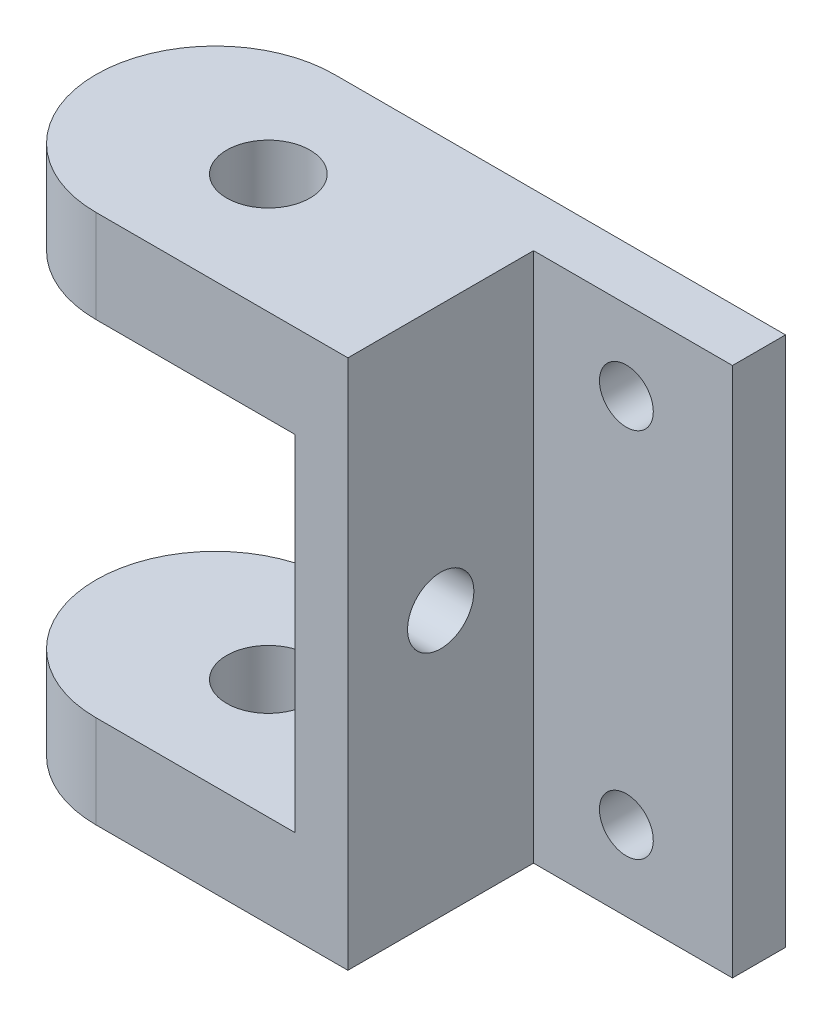
ISO-10303-21;
HEADER;
FILE_DESCRIPTION(('STEP AP214'),'2;1');
FILE_NAME('part.step','',(''),(''),'','','');
FILE_SCHEMA(('AUTOMOTIVE_DESIGN { 1 0 10303 214 1 1 1 1 }'));
ENDSEC;
DATA;
#1=APPLICATION_CONTEXT('core data for automotive mechanical design processes');
#2=APPLICATION_PROTOCOL_DEFINITION('international standard','automotive_design',2000,#1);
#3=PRODUCT_CONTEXT('',#1,'mechanical');
#4=PRODUCT('Part','Part','',(#3));
#5=PRODUCT_RELATED_PRODUCT_CATEGORY('part','',(#4));
#6=PRODUCT_DEFINITION_FORMATION('','',#4);
#7=PRODUCT_DEFINITION_CONTEXT('part definition',#1,'design');
#8=PRODUCT_DEFINITION('design','',#6,#7);
#9=PRODUCT_DEFINITION_SHAPE('','',#8);
#10=(LENGTH_UNIT() NAMED_UNIT(*) SI_UNIT(.MILLI.,.METRE.));
#11=(NAMED_UNIT(*) PLANE_ANGLE_UNIT() SI_UNIT($,.RADIAN.));
#12=(NAMED_UNIT(*) SI_UNIT($,.STERADIAN.) SOLID_ANGLE_UNIT());
#13=UNCERTAINTY_MEASURE_WITH_UNIT(LENGTH_MEASURE(1.E-05),#10,'distance_accuracy_value','');
#14=(GEOMETRIC_REPRESENTATION_CONTEXT(3) GLOBAL_UNCERTAINTY_ASSIGNED_CONTEXT((#13)) GLOBAL_UNIT_ASSIGNED_CONTEXT((#10,
#11,#12)) REPRESENTATION_CONTEXT('',''));
#15=CARTESIAN_POINT('',(0.,0.,0.));
#16=DIRECTION('',(0.,0.,1.));
#17=DIRECTION('',(1.,0.,0.));
#18=AXIS2_PLACEMENT_3D('',#15,#16,#17);
#19=CARTESIAN_POINT('',(0.,0.,0.));
#20=DIRECTION('',(1.,0.,0.));
#21=DIRECTION('',(0.,0.,-1.));
#22=AXIS2_PLACEMENT_3D('',#19,#20,#21);
#23=PLANE('',#22);
#24=CARTESIAN_POINT('',(0.,0.,0.200000000000002));
#25=DIRECTION('',(1.,0.,0.));
#26=DIRECTION('',(0.,0.,-1.));
#27=AXIS2_PLACEMENT_3D('',#24,#25,#26);
#28=CIRCLE('',#27,0.25);
#29=CARTESIAN_POINT('',(0.,0.,-0.0499999999999983));
#30=VERTEX_POINT('',#29);
#31=EDGE_CURVE('E277',#30,#30,#28,.T.);
#32=ORIENTED_EDGE('',*,*,#31,.T.);
#33=EDGE_LOOP('',(#32));
#34=FACE_BOUND('',#33,.T.);
#35=DIRECTION('',(0.,-1.,0.));
#36=VECTOR('',#35,1.);
#37=CARTESIAN_POINT('',(0.,0.,-0.899999999999998));
#38=LINE('',#37,#36);
#39=CARTESIAN_POINT('',(0.,1.3,-0.899999999999998));
#40=VERTEX_POINT('',#39);
#41=CARTESIAN_POINT('',(0.,-1.3,-0.899999999999999));
#42=VERTEX_POINT('',#41);
#43=EDGE_CURVE('E126',#40,#42,#38,.T.);
#44=ORIENTED_EDGE('',*,*,#43,.T.);
#45=DIRECTION('',(0.,0.,1.));
#46=VECTOR('',#45,1.);
#47=CARTESIAN_POINT('',(0.,-1.3,0.));
#48=LINE('',#47,#46);
#49=CARTESIAN_POINT('',(0.,-1.3,0.900000000000001));
#50=VERTEX_POINT('',#49);
#51=EDGE_CURVE('E130',#42,#50,#48,.T.);
#52=ORIENTED_EDGE('',*,*,#51,.T.);
#53=DIRECTION('',(0.,-1.,0.));
#54=VECTOR('',#53,1.);
#55=CARTESIAN_POINT('',(0.,0.,0.900000000000001));
#56=LINE('',#55,#54);
#57=CARTESIAN_POINT('',(0.,1.3,0.900000000000001));
#58=VERTEX_POINT('',#57);
#59=EDGE_CURVE('E153',#58,#50,#56,.T.);
#60=ORIENTED_EDGE('',*,*,#59,.F.);
#61=DIRECTION('',(0.,0.,1.));
#62=VECTOR('',#61,1.);
#63=CARTESIAN_POINT('',(0.,1.3,0.));
#64=LINE('',#63,#62);
#65=EDGE_CURVE('E142',#40,#58,#64,.T.);
#66=ORIENTED_EDGE('',*,*,#65,.F.);
#67=EDGE_LOOP('',(#44,#52,#60,#66));
#68=FACE_BOUND('',#67,.T.);
#69=ADVANCED_FACE('F34',(#34,#68),#23,.F.);
#70=CARTESIAN_POINT('',(0.4,0.,0.900000000000001));
#71=DIRECTION('',(0.,0.,-1.));
#72=DIRECTION('',(0.,1.,0.));
#73=AXIS2_PLACEMENT_3D('',#70,#71,#72);
#74=PLANE('',#73);
#75=DIRECTION('',(-1.,0.,0.));
#76=VECTOR('',#75,1.);
#77=CARTESIAN_POINT('',(0.4,2.,0.900000000000001));
#78=LINE('',#77,#76);
#79=CARTESIAN_POINT('',(0.4,2.,0.900000000000001));
#80=VERTEX_POINT('',#79);
#81=CARTESIAN_POINT('',(-1.5,2.,0.900000000000001));
#82=VERTEX_POINT('',#81);
#83=EDGE_CURVE('E207',#80,#82,#78,.T.);
#84=ORIENTED_EDGE('',*,*,#83,.T.);
#85=DIRECTION('',(0.,-1.,0.));
#86=VECTOR('',#85,1.);
#87=CARTESIAN_POINT('',(-1.5,0.,0.900000000000001));
#88=LINE('',#87,#86);
#89=CARTESIAN_POINT('',(-1.5,1.3,0.900000000000001));
#90=VERTEX_POINT('',#89);
#91=EDGE_CURVE('E225',#82,#90,#88,.T.);
#92=ORIENTED_EDGE('',*,*,#91,.T.);
#93=DIRECTION('',(1.,0.,0.));
#94=VECTOR('',#93,1.);
#95=CARTESIAN_POINT('',(-2.4,1.3,0.900000000000001));
#96=LINE('',#95,#94);
#97=EDGE_CURVE('E192',#90,#58,#96,.T.);
#98=ORIENTED_EDGE('',*,*,#97,.T.);
#99=ORIENTED_EDGE('',*,*,#59,.T.);
#100=DIRECTION('',(1.,0.,0.));
#101=VECTOR('',#100,1.);
#102=CARTESIAN_POINT('',(-2.4,-1.3,0.900000000000001));
#103=LINE('',#102,#101);
#104=CARTESIAN_POINT('',(-1.5,-1.3,0.900000000000001));
#105=VERTEX_POINT('',#104);
#106=EDGE_CURVE('E129',#105,#50,#103,.T.);
#107=ORIENTED_EDGE('',*,*,#106,.F.);
#108=DIRECTION('',(0.,-1.,0.));
#109=VECTOR('',#108,1.);
#110=CARTESIAN_POINT('',(-1.5,0.,0.900000000000001));
#111=LINE('',#110,#109);
#112=CARTESIAN_POINT('',(-1.5,-2.,0.900000000000001));
#113=VERTEX_POINT('',#112);
#114=EDGE_CURVE('E170',#105,#113,#111,.T.);
#115=ORIENTED_EDGE('',*,*,#114,.T.);
#116=DIRECTION('',(-1.,0.,0.));
#117=VECTOR('',#116,1.);
#118=CARTESIAN_POINT('',(0.4,-2.,0.900000000000001));
#119=LINE('',#118,#117);
#120=CARTESIAN_POINT('',(0.4,-2.,0.900000000000001));
#121=VERTEX_POINT('',#120);
#122=EDGE_CURVE('E201',#121,#113,#119,.T.);
#123=ORIENTED_EDGE('',*,*,#122,.F.);
#124=DIRECTION('',(0.,-1.,0.));
#125=VECTOR('',#124,1.);
#126=CARTESIAN_POINT('',(0.4,0.,0.900000000000001));
#127=LINE('',#126,#125);
#128=EDGE_CURVE('E163',#80,#121,#127,.T.);
#129=ORIENTED_EDGE('',*,*,#128,.F.);
#130=EDGE_LOOP('',(#84,#92,#98,#99,#107,#115,#123,#129));
#131=FACE_BOUND('',#130,.T.);
#132=ADVANCED_FACE('F221',(#131),#74,.F.);
#133=CARTESIAN_POINT('',(0.4,0.,0.));
#134=DIRECTION('',(1.,0.,0.));
#135=DIRECTION('',(0.,0.,-1.));
#136=AXIS2_PLACEMENT_3D('',#133,#134,#135);
#137=PLANE('',#136);
#138=CARTESIAN_POINT('',(0.4,0.,0.200000000000002));
#139=DIRECTION('',(1.,0.,0.));
#140=DIRECTION('',(0.,0.,-1.));
#141=AXIS2_PLACEMENT_3D('',#138,#139,#140);
#142=CIRCLE('',#141,0.25);
#143=CARTESIAN_POINT('',(0.4,0.,-0.0499999999999983));
#144=VERTEX_POINT('',#143);
#145=EDGE_CURVE('E274',#144,#144,#142,.T.);
#146=ORIENTED_EDGE('',*,*,#145,.F.);
#147=EDGE_LOOP('',(#146));
#148=FACE_BOUND('',#147,.T.);
#149=ORIENTED_EDGE('',*,*,#128,.T.);
#150=DIRECTION('',(0.,0.,-1.));
#151=VECTOR('',#150,1.);
#152=CARTESIAN_POINT('',(0.4,-2.,0.));
#153=LINE('',#152,#151);
#154=CARTESIAN_POINT('',(0.4,-2.,-0.499999999999998));
#155=VERTEX_POINT('',#154);
#156=EDGE_CURVE('E187',#121,#155,#153,.T.);
#157=ORIENTED_EDGE('',*,*,#156,.T.);
#158=DIRECTION('',(0.,-1.,0.));
#159=VECTOR('',#158,1.);
#160=CARTESIAN_POINT('',(0.4,0.,-0.499999999999998));
#161=LINE('',#160,#159);
#162=CARTESIAN_POINT('',(0.400000000000001,2.,-0.499999999999998));
#163=VERTEX_POINT('',#162);
#164=EDGE_CURVE('E164',#163,#155,#161,.T.);
#165=ORIENTED_EDGE('',*,*,#164,.F.);
#166=DIRECTION('',(0.,0.,-1.));
#167=VECTOR('',#166,1.);
#168=CARTESIAN_POINT('',(0.4,2.,0.));
#169=LINE('',#168,#167);
#170=EDGE_CURVE('E204',#80,#163,#169,.T.);
#171=ORIENTED_EDGE('',*,*,#170,.F.);
#172=EDGE_LOOP('',(#149,#157,#165,#171));
#173=FACE_BOUND('',#172,.T.);
#174=ADVANCED_FACE('F216',(#148,#173),#137,.T.);
#175=CARTESIAN_POINT('',(1.9,0.,-0.499999999999998));
#176=DIRECTION('',(0.,0.,-1.));
#177=DIRECTION('',(-1.,0.,0.));
#178=AXIS2_PLACEMENT_3D('',#175,#176,#177);
#179=PLANE('',#178);
#180=CARTESIAN_POINT('',(1.1,-1.4,-0.499999999999998));
#181=DIRECTION('',(0.,0.,1.));
#182=DIRECTION('',(-1.,0.,0.));
#183=AXIS2_PLACEMENT_3D('',#180,#181,#182);
#184=CIRCLE('',#183,0.203);
#185=CARTESIAN_POINT('',(0.897000000000001,-1.4,-0.499999999999998));
#186=VERTEX_POINT('',#185);
#187=EDGE_CURVE('E257',#186,#186,#184,.T.);
#188=ORIENTED_EDGE('',*,*,#187,.F.);
#189=EDGE_LOOP('',(#188));
#190=FACE_BOUND('',#189,.T.);
#191=CARTESIAN_POINT('',(1.1,1.4,-0.499999999999998));
#192=DIRECTION('',(0.,0.,1.));
#193=DIRECTION('',(1.,0.,0.));
#194=AXIS2_PLACEMENT_3D('',#191,#192,#193);
#195=CIRCLE('',#194,0.203);
#196=CARTESIAN_POINT('',(1.303,1.4,-0.499999999999998));
#197=VERTEX_POINT('',#196);
#198=EDGE_CURVE('E254',#197,#197,#195,.T.);
#199=ORIENTED_EDGE('',*,*,#198,.F.);
#200=EDGE_LOOP('',(#199));
#201=FACE_BOUND('',#200,.T.);
#202=DIRECTION('',(-1.,0.,0.));
#203=VECTOR('',#202,1.);
#204=CARTESIAN_POINT('',(1.9,2.,-0.499999999999998));
#205=LINE('',#204,#203);
#206=CARTESIAN_POINT('',(1.9,2.,-0.499999999999998));
#207=VERTEX_POINT('',#206);
#208=EDGE_CURVE('E148',#207,#163,#205,.T.);
#209=ORIENTED_EDGE('',*,*,#208,.T.);
#210=ORIENTED_EDGE('',*,*,#164,.T.);
#211=DIRECTION('',(-1.,0.,0.));
#212=VECTOR('',#211,1.);
#213=CARTESIAN_POINT('',(1.9,-2.,-0.499999999999998));
#214=LINE('',#213,#212);
#215=CARTESIAN_POINT('',(1.9,-2.,-0.499999999999998));
#216=VERTEX_POINT('',#215);
#217=EDGE_CURVE('E183',#216,#155,#214,.T.);
#218=ORIENTED_EDGE('',*,*,#217,.F.);
#219=DIRECTION('',(0.,-1.,0.));
#220=VECTOR('',#219,1.);
#221=CARTESIAN_POINT('',(1.9,0.,-0.499999999999998));
#222=LINE('',#221,#220);
#223=EDGE_CURVE('E146',#207,#216,#222,.T.);
#224=ORIENTED_EDGE('',*,*,#223,.F.);
#225=EDGE_LOOP('',(#209,#210,#218,#224));
#226=FACE_BOUND('',#225,.T.);
#227=ADVANCED_FACE('F184',(#190,#201,#226),#179,.F.);
#228=CARTESIAN_POINT('',(1.9,0.,-0.899999999999998));
#229=DIRECTION('',(0.,0.,-1.));
#230=DIRECTION('',(0.,1.,0.));
#231=AXIS2_PLACEMENT_3D('',#228,#229,#230);
#232=PLANE('',#231);
#233=CARTESIAN_POINT('',(1.1,-1.4,-0.899999999999999));
#234=DIRECTION('',(0.,0.,-1.));
#235=DIRECTION('',(0.,1.,0.));
#236=AXIS2_PLACEMENT_3D('',#233,#234,#235);
#237=CIRCLE('',#236,0.203);
#238=CARTESIAN_POINT('',(1.1,-1.197,-0.899999999999999));
#239=VERTEX_POINT('',#238);
#240=EDGE_CURVE('E255',#239,#239,#237,.T.);
#241=ORIENTED_EDGE('',*,*,#240,.F.);
#242=EDGE_LOOP('',(#241));
#243=FACE_BOUND('',#242,.T.);
#244=CARTESIAN_POINT('',(1.1,1.4,-0.899999999999998));
#245=DIRECTION('',(0.,0.,-1.));
#246=DIRECTION('',(0.,1.,0.));
#247=AXIS2_PLACEMENT_3D('',#244,#245,#246);
#248=CIRCLE('',#247,0.203);
#249=CARTESIAN_POINT('',(1.1,1.603,-0.899999999999998));
#250=VERTEX_POINT('',#249);
#251=EDGE_CURVE('E138',#250,#250,#248,.T.);
#252=ORIENTED_EDGE('',*,*,#251,.F.);
#253=EDGE_LOOP('',(#252));
#254=FACE_BOUND('',#253,.T.);
#255=DIRECTION('',(-1.,0.,0.));
#256=VECTOR('',#255,1.);
#257=CARTESIAN_POINT('',(1.9,-2.,-0.899999999999999));
#258=LINE('',#257,#256);
#259=CARTESIAN_POINT('',(1.9,-2.,-0.899999999999999));
#260=VERTEX_POINT('',#259);
#261=CARTESIAN_POINT('',(-1.5,-2.,-0.899999999999999));
#262=VERTEX_POINT('',#261);
#263=EDGE_CURVE('E188',#260,#262,#258,.T.);
#264=ORIENTED_EDGE('',*,*,#263,.T.);
#265=DIRECTION('',(0.,-1.,0.));
#266=VECTOR('',#265,1.);
#267=CARTESIAN_POINT('',(-1.5,-1.3,-0.899999999999999));
#268=LINE('',#267,#266);
#269=CARTESIAN_POINT('',(-1.5,-1.3,-0.899999999999999));
#270=VERTEX_POINT('',#269);
#271=EDGE_CURVE('E49',#262,#270,#268,.F.);
#272=ORIENTED_EDGE('',*,*,#271,.T.);
#273=DIRECTION('',(1.,0.,0.));
#274=VECTOR('',#273,1.);
#275=CARTESIAN_POINT('',(-2.4,-1.3,-0.899999999999999));
#276=LINE('',#275,#274);
#277=EDGE_CURVE('E122',#270,#42,#276,.T.);
#278=ORIENTED_EDGE('',*,*,#277,.T.);
#279=ORIENTED_EDGE('',*,*,#43,.F.);
#280=DIRECTION('',(1.,0.,0.));
#281=VECTOR('',#280,1.);
#282=CARTESIAN_POINT('',(-2.4,1.3,-0.899999999999998));
#283=LINE('',#282,#281);
#284=CARTESIAN_POINT('',(-1.5,1.3,-0.899999999999998));
#285=VERTEX_POINT('',#284);
#286=EDGE_CURVE('E195',#285,#40,#283,.T.);
#287=ORIENTED_EDGE('',*,*,#286,.F.);
#288=DIRECTION('',(0.,-1.,0.));
#289=VECTOR('',#288,1.);
#290=CARTESIAN_POINT('',(-1.5,2.,-0.899999999999998));
#291=LINE('',#290,#289);
#292=CARTESIAN_POINT('',(-1.5,2.,-0.899999999999998));
#293=VERTEX_POINT('',#292);
#294=EDGE_CURVE('E56',#285,#293,#291,.F.);
#295=ORIENTED_EDGE('',*,*,#294,.T.);
#296=DIRECTION('',(-1.,0.,0.));
#297=VECTOR('',#296,1.);
#298=CARTESIAN_POINT('',(1.9,2.,-0.899999999999998));
#299=LINE('',#298,#297);
#300=CARTESIAN_POINT('',(1.9,2.,-0.899999999999998));
#301=VERTEX_POINT('',#300);
#302=EDGE_CURVE('E144',#301,#293,#299,.T.);
#303=ORIENTED_EDGE('',*,*,#302,.F.);
#304=DIRECTION('',(0.,-1.,0.));
#305=VECTOR('',#304,1.);
#306=CARTESIAN_POINT('',(1.9,0.,-0.899999999999998));
#307=LINE('',#306,#305);
#308=EDGE_CURVE('E143',#301,#260,#307,.T.);
#309=ORIENTED_EDGE('',*,*,#308,.T.);
#310=EDGE_LOOP('',(#264,#272,#278,#279,#287,#295,#303,#309));
#311=FACE_BOUND('',#310,.T.);
#312=ADVANCED_FACE('F124',(#243,#254,#311),#232,.T.);
#313=CARTESIAN_POINT('',(1.9,0.,0.));
#314=DIRECTION('',(1.,0.,0.));
#315=DIRECTION('',(0.,0.,-1.));
#316=AXIS2_PLACEMENT_3D('',#313,#314,#315);
#317=PLANE('',#316);
#318=ORIENTED_EDGE('',*,*,#223,.T.);
#319=DIRECTION('',(0.,0.,-1.));
#320=VECTOR('',#319,1.);
#321=CARTESIAN_POINT('',(1.9,-2.,0.));
#322=LINE('',#321,#320);
#323=EDGE_CURVE('E177',#216,#260,#322,.T.);
#324=ORIENTED_EDGE('',*,*,#323,.T.);
#325=ORIENTED_EDGE('',*,*,#308,.F.);
#326=DIRECTION('',(0.,0.,-1.));
#327=VECTOR('',#326,1.);
#328=CARTESIAN_POINT('',(1.9,2.,0.));
#329=LINE('',#328,#327);
#330=EDGE_CURVE('E180',#207,#301,#329,.T.);
#331=ORIENTED_EDGE('',*,*,#330,.F.);
#332=EDGE_LOOP('',(#318,#324,#325,#331));
#333=FACE_BOUND('',#332,.T.);
#334=ADVANCED_FACE('F175',(#333),#317,.T.);
#335=CARTESIAN_POINT('',(1.9,2.,0.));
#336=DIRECTION('',(0.,1.,0.));
#337=DIRECTION('',(0.,0.,1.));
#338=AXIS2_PLACEMENT_3D('',#335,#336,#337);
#339=PLANE('',#338);
#340=CARTESIAN_POINT('',(-1.1,2.,0.));
#341=DIRECTION('',(0.,1.,0.));
#342=DIRECTION('',(0.,0.,1.));
#343=AXIS2_PLACEMENT_3D('',#340,#341,#342);
#344=CIRCLE('',#343,0.314);
#345=CARTESIAN_POINT('',(-1.1,2.,0.313999999999999));
#346=VERTEX_POINT('',#345);
#347=EDGE_CURVE('E265',#346,#346,#344,.T.);
#348=ORIENTED_EDGE('',*,*,#347,.F.);
#349=EDGE_LOOP('',(#348));
#350=FACE_BOUND('',#349,.T.);
#351=ORIENTED_EDGE('',*,*,#302,.T.);
#352=CARTESIAN_POINT('',(-1.5,2.,0.));
#353=DIRECTION('',(0.,1.,0.));
#354=DIRECTION('',(0.,0.,1.));
#355=AXIS2_PLACEMENT_3D('',#352,#353,#354);
#356=CIRCLE('',#355,0.9);
#357=CARTESIAN_POINT('',(-2.4,2.,0.));
#358=VERTEX_POINT('',#357);
#359=EDGE_CURVE('E11',#293,#358,#356,.T.);
#360=ORIENTED_EDGE('',*,*,#359,.T.);
#361=CARTESIAN_POINT('',(-1.5,2.,0.));
#362=DIRECTION('',(0.,1.,0.));
#363=DIRECTION('',(0.,0.,1.));
#364=AXIS2_PLACEMENT_3D('',#361,#362,#363);
#365=CIRCLE('',#364,0.9);
#366=EDGE_CURVE('E237',#358,#82,#365,.T.);
#367=ORIENTED_EDGE('',*,*,#366,.T.);
#368=ORIENTED_EDGE('',*,*,#83,.F.);
#369=ORIENTED_EDGE('',*,*,#170,.T.);
#370=ORIENTED_EDGE('',*,*,#208,.F.);
#371=ORIENTED_EDGE('',*,*,#330,.T.);
#372=EDGE_LOOP('',(#351,#360,#367,#368,#369,#370,#371));
#373=FACE_BOUND('',#372,.T.);
#374=ADVANCED_FACE('F214',(#350,#373),#339,.T.);
#375=CARTESIAN_POINT('',(0.4,-2.,0.));
#376=DIRECTION('',(0.,1.,0.));
#377=DIRECTION('',(0.,0.,1.));
#378=AXIS2_PLACEMENT_3D('',#375,#376,#377);
#379=PLANE('',#378);
#380=CARTESIAN_POINT('',(-1.1,-2.,0.));
#381=DIRECTION('',(0.,-1.,0.));
#382=DIRECTION('',(0.,0.,-1.));
#383=AXIS2_PLACEMENT_3D('',#380,#381,#382);
#384=CIRCLE('',#383,0.314);
#385=CARTESIAN_POINT('',(-1.1,-2.,-0.313999999999999));
#386=VERTEX_POINT('',#385);
#387=EDGE_CURVE('E261',#386,#386,#384,.T.);
#388=ORIENTED_EDGE('',*,*,#387,.F.);
#389=EDGE_LOOP('',(#388));
#390=FACE_BOUND('',#389,.T.);
#391=CARTESIAN_POINT('',(-1.5,-2.,0.));
#392=DIRECTION('',(0.,1.,0.));
#393=DIRECTION('',(0.,0.,1.));
#394=AXIS2_PLACEMENT_3D('',#391,#392,#393);
#395=CIRCLE('',#394,0.9);
#396=CARTESIAN_POINT('',(-2.4,-2.,0.));
#397=VERTEX_POINT('',#396);
#398=EDGE_CURVE('E218',#113,#397,#395,.F.);
#399=ORIENTED_EDGE('',*,*,#398,.T.);
#400=CARTESIAN_POINT('',(-1.5,-2.,0.));
#401=DIRECTION('',(0.,1.,0.));
#402=DIRECTION('',(0.,0.,1.));
#403=AXIS2_PLACEMENT_3D('',#400,#401,#402);
#404=CIRCLE('',#403,0.9);
#405=EDGE_CURVE('E245',#397,#262,#404,.F.);
#406=ORIENTED_EDGE('',*,*,#405,.T.);
#407=ORIENTED_EDGE('',*,*,#263,.F.);
#408=ORIENTED_EDGE('',*,*,#323,.F.);
#409=ORIENTED_EDGE('',*,*,#217,.T.);
#410=ORIENTED_EDGE('',*,*,#156,.F.);
#411=ORIENTED_EDGE('',*,*,#122,.T.);
#412=EDGE_LOOP('',(#399,#406,#407,#408,#409,#410,#411));
#413=FACE_BOUND('',#412,.T.);
#414=ADVANCED_FACE('F191',(#390,#413),#379,.F.);
#415=CARTESIAN_POINT('',(-2.4,1.3,0.));
#416=DIRECTION('',(0.,1.,0.));
#417=DIRECTION('',(0.,0.,1.));
#418=AXIS2_PLACEMENT_3D('',#415,#416,#417);
#419=PLANE('',#418);
#420=CARTESIAN_POINT('',(-1.1,1.3,0.));
#421=DIRECTION('',(0.,1.,0.));
#422=DIRECTION('',(0.,0.,1.));
#423=AXIS2_PLACEMENT_3D('',#420,#421,#422);
#424=CIRCLE('',#423,0.314);
#425=CARTESIAN_POINT('',(-1.1,1.3,0.313999999999999));
#426=VERTEX_POINT('',#425);
#427=EDGE_CURVE('E260',#426,#426,#424,.T.);
#428=ORIENTED_EDGE('',*,*,#427,.T.);
#429=EDGE_LOOP('',(#428));
#430=FACE_BOUND('',#429,.T.);
#431=CARTESIAN_POINT('',(-1.5,1.3,0.));
#432=DIRECTION('',(0.,1.,0.));
#433=DIRECTION('',(0.,0.,1.));
#434=AXIS2_PLACEMENT_3D('',#431,#432,#433);
#435=CIRCLE('',#434,0.9);
#436=CARTESIAN_POINT('',(-2.4,1.3,0.));
#437=VERTEX_POINT('',#436);
#438=EDGE_CURVE('E228',#90,#437,#435,.F.);
#439=ORIENTED_EDGE('',*,*,#438,.T.);
#440=CARTESIAN_POINT('',(-1.5,1.3,0.));
#441=DIRECTION('',(0.,1.,0.));
#442=DIRECTION('',(0.,0.,1.));
#443=AXIS2_PLACEMENT_3D('',#440,#441,#442);
#444=CIRCLE('',#443,0.9);
#445=EDGE_CURVE('E42',#437,#285,#444,.F.);
#446=ORIENTED_EDGE('',*,*,#445,.T.);
#447=ORIENTED_EDGE('',*,*,#286,.T.);
#448=ORIENTED_EDGE('',*,*,#65,.T.);
#449=ORIENTED_EDGE('',*,*,#97,.F.);
#450=EDGE_LOOP('',(#439,#446,#447,#448,#449));
#451=FACE_BOUND('',#450,.T.);
#452=ADVANCED_FACE('F286',(#430,#451),#419,.F.);
#453=CARTESIAN_POINT('',(-2.4,-1.3,0.));
#454=DIRECTION('',(0.,1.,0.));
#455=DIRECTION('',(0.,0.,1.));
#456=AXIS2_PLACEMENT_3D('',#453,#454,#455);
#457=PLANE('',#456);
#458=CARTESIAN_POINT('',(-1.1,-1.3,0.));
#459=DIRECTION('',(0.,1.,0.));
#460=DIRECTION('',(0.,0.,1.));
#461=AXIS2_PLACEMENT_3D('',#458,#459,#460);
#462=CIRCLE('',#461,0.314);
#463=CARTESIAN_POINT('',(-1.1,-1.3,0.314000000000001));
#464=VERTEX_POINT('',#463);
#465=EDGE_CURVE('E258',#464,#464,#462,.T.);
#466=ORIENTED_EDGE('',*,*,#465,.F.);
#467=EDGE_LOOP('',(#466));
#468=FACE_BOUND('',#467,.T.);
#469=ORIENTED_EDGE('',*,*,#277,.F.);
#470=CARTESIAN_POINT('',(-1.5,-1.3,0.));
#471=DIRECTION('',(0.,1.,0.));
#472=DIRECTION('',(0.,0.,1.));
#473=AXIS2_PLACEMENT_3D('',#470,#471,#472);
#474=CIRCLE('',#473,0.9);
#475=CARTESIAN_POINT('',(-2.4,-1.3,0.));
#476=VERTEX_POINT('',#475);
#477=EDGE_CURVE('E289',#270,#476,#474,.T.);
#478=ORIENTED_EDGE('',*,*,#477,.T.);
#479=CARTESIAN_POINT('',(-1.5,-1.3,0.));
#480=DIRECTION('',(0.,1.,0.));
#481=DIRECTION('',(0.,0.,1.));
#482=AXIS2_PLACEMENT_3D('',#479,#480,#481);
#483=CIRCLE('',#482,0.9);
#484=EDGE_CURVE('E243',#476,#105,#483,.T.);
#485=ORIENTED_EDGE('',*,*,#484,.T.);
#486=ORIENTED_EDGE('',*,*,#106,.T.);
#487=ORIENTED_EDGE('',*,*,#51,.F.);
#488=EDGE_LOOP('',(#469,#478,#485,#486,#487));
#489=FACE_BOUND('',#488,.T.);
#490=ADVANCED_FACE('F133',(#468,#489),#457,.T.);
#491=CARTESIAN_POINT('',(1.1,1.4,-2.9));
#492=DIRECTION('',(0.,0.,1.));
#493=DIRECTION('',(1.,0.,0.));
#494=AXIS2_PLACEMENT_3D('',#491,#492,#493);
#495=CYLINDRICAL_SURFACE('',#494,0.203);
#496=ORIENTED_EDGE('',*,*,#251,.T.);
#497=EDGE_LOOP('',(#496));
#498=FACE_BOUND('',#497,.T.);
#499=ORIENTED_EDGE('',*,*,#198,.T.);
#500=EDGE_LOOP('',(#499));
#501=FACE_BOUND('',#500,.T.);
#502=ADVANCED_FACE('F340',(#498,#501),#495,.F.);
#503=CARTESIAN_POINT('',(1.1,-1.4,-2.9));
#504=DIRECTION('',(0.,0.,1.));
#505=DIRECTION('',(1.,0.,0.));
#506=AXIS2_PLACEMENT_3D('',#503,#504,#505);
#507=CYLINDRICAL_SURFACE('',#506,0.203);
#508=ORIENTED_EDGE('',*,*,#240,.T.);
#509=EDGE_LOOP('',(#508));
#510=FACE_BOUND('',#509,.T.);
#511=ORIENTED_EDGE('',*,*,#187,.T.);
#512=EDGE_LOOP('',(#511));
#513=FACE_BOUND('',#512,.T.);
#514=ADVANCED_FACE('F344',(#510,#513),#507,.F.);
#515=CARTESIAN_POINT('',(-2.,0.,0.200000000000002));
#516=DIRECTION('',(1.,0.,0.));
#517=DIRECTION('',(0.,0.,-1.));
#518=AXIS2_PLACEMENT_3D('',#515,#516,#517);
#519=CYLINDRICAL_SURFACE('',#518,0.25);
#520=ORIENTED_EDGE('',*,*,#145,.T.);
#521=EDGE_LOOP('',(#520));
#522=FACE_BOUND('',#521,.T.);
#523=ORIENTED_EDGE('',*,*,#31,.F.);
#524=EDGE_LOOP('',(#523));
#525=FACE_BOUND('',#524,.T.);
#526=ADVANCED_FACE('F348',(#522,#525),#519,.F.);
#527=CARTESIAN_POINT('',(-1.1,8.,0.));
#528=DIRECTION('',(0.,-1.,0.));
#529=DIRECTION('',(0.,0.,-1.));
#530=AXIS2_PLACEMENT_3D('',#527,#528,#529);
#531=CYLINDRICAL_SURFACE('',#530,0.314);
#532=ORIENTED_EDGE('',*,*,#465,.T.);
#533=EDGE_LOOP('',(#532));
#534=FACE_BOUND('',#533,.T.);
#535=ORIENTED_EDGE('',*,*,#387,.T.);
#536=EDGE_LOOP('',(#535));
#537=FACE_BOUND('',#536,.T.);
#538=ADVANCED_FACE('F307',(#534,#537),#531,.F.);
#539=ORIENTED_EDGE('',*,*,#347,.T.);
#540=EDGE_LOOP('',(#539));
#541=FACE_BOUND('',#540,.T.);
#542=ORIENTED_EDGE('',*,*,#427,.F.);
#543=EDGE_LOOP('',(#542));
#544=FACE_BOUND('',#543,.T.);
#545=ADVANCED_FACE('F300',(#541,#544),#531,.F.);
#546=CARTESIAN_POINT('',(-1.5,0.,0.));
#547=DIRECTION('',(0.,-1.,0.));
#548=DIRECTION('',(0.,0.,-1.));
#549=AXIS2_PLACEMENT_3D('',#546,#547,#548);
#550=CYLINDRICAL_SURFACE('',#549,0.9);
#551=ORIENTED_EDGE('',*,*,#366,.F.);
#552=DIRECTION('',(0.,-1.,0.));
#553=VECTOR('',#552,1.);
#554=CARTESIAN_POINT('',(-2.4,0.,0.));
#555=LINE('',#554,#553);
#556=EDGE_CURVE('E234',#437,#358,#555,.F.);
#557=ORIENTED_EDGE('',*,*,#556,.F.);
#558=ORIENTED_EDGE('',*,*,#438,.F.);
#559=ORIENTED_EDGE('',*,*,#91,.F.);
#560=EDGE_LOOP('',(#551,#557,#558,#559));
#561=FACE_BOUND('',#560,.T.);
#562=ADVANCED_FACE('F298',(#561),#550,.T.);
#563=CARTESIAN_POINT('',(-1.5,0.,0.));
#564=DIRECTION('',(0.,-1.,0.));
#565=DIRECTION('',(0.,0.,-1.));
#566=AXIS2_PLACEMENT_3D('',#563,#564,#565);
#567=CYLINDRICAL_SURFACE('',#566,0.9);
#568=ORIENTED_EDGE('',*,*,#484,.F.);
#569=DIRECTION('',(0.,-1.,0.));
#570=VECTOR('',#569,1.);
#571=CARTESIAN_POINT('',(-2.4,0.,0.));
#572=LINE('',#571,#570);
#573=EDGE_CURVE('E240',#397,#476,#572,.F.);
#574=ORIENTED_EDGE('',*,*,#573,.F.);
#575=ORIENTED_EDGE('',*,*,#398,.F.);
#576=ORIENTED_EDGE('',*,*,#114,.F.);
#577=EDGE_LOOP('',(#568,#574,#575,#576));
#578=FACE_BOUND('',#577,.T.);
#579=ADVANCED_FACE('F292',(#578),#567,.T.);
#580=CARTESIAN_POINT('',(-1.5,0.,0.));
#581=DIRECTION('',(0.,1.,0.));
#582=DIRECTION('',(0.,0.,1.));
#583=AXIS2_PLACEMENT_3D('',#580,#581,#582);
#584=CYLINDRICAL_SURFACE('',#583,0.9);
#585=ORIENTED_EDGE('',*,*,#477,.F.);
#586=ORIENTED_EDGE('',*,*,#271,.F.);
#587=ORIENTED_EDGE('',*,*,#405,.F.);
#588=ORIENTED_EDGE('',*,*,#573,.T.);
#589=EDGE_LOOP('',(#585,#586,#587,#588));
#590=FACE_BOUND('',#589,.T.);
#591=ADVANCED_FACE('F293',(#590),#584,.T.);
#592=CARTESIAN_POINT('',(-1.5,0.,0.));
#593=DIRECTION('',(0.,1.,0.));
#594=DIRECTION('',(0.,0.,1.));
#595=AXIS2_PLACEMENT_3D('',#592,#593,#594);
#596=CYLINDRICAL_SURFACE('',#595,0.9);
#597=ORIENTED_EDGE('',*,*,#359,.F.);
#598=ORIENTED_EDGE('',*,*,#294,.F.);
#599=ORIENTED_EDGE('',*,*,#445,.F.);
#600=ORIENTED_EDGE('',*,*,#556,.T.);
#601=EDGE_LOOP('',(#597,#598,#599,#600));
#602=FACE_BOUND('',#601,.T.);
#603=ADVANCED_FACE('F36',(#602),#596,.T.);
#604=CLOSED_SHELL('',(#69,#132,#174,#227,#312,#334,#374,#414,#452,#490,#502,#514,#526,#538,#545,
#562,#579,#591,#603));
#605=MANIFOLD_SOLID_BREP('B2',#604);
#606=ADVANCED_BREP_SHAPE_REPRESENTATION('',(#18,#605),#14);
#607=SHAPE_DEFINITION_REPRESENTATION(#9,#606);
ENDSEC;
END-ISO-10303-21;
